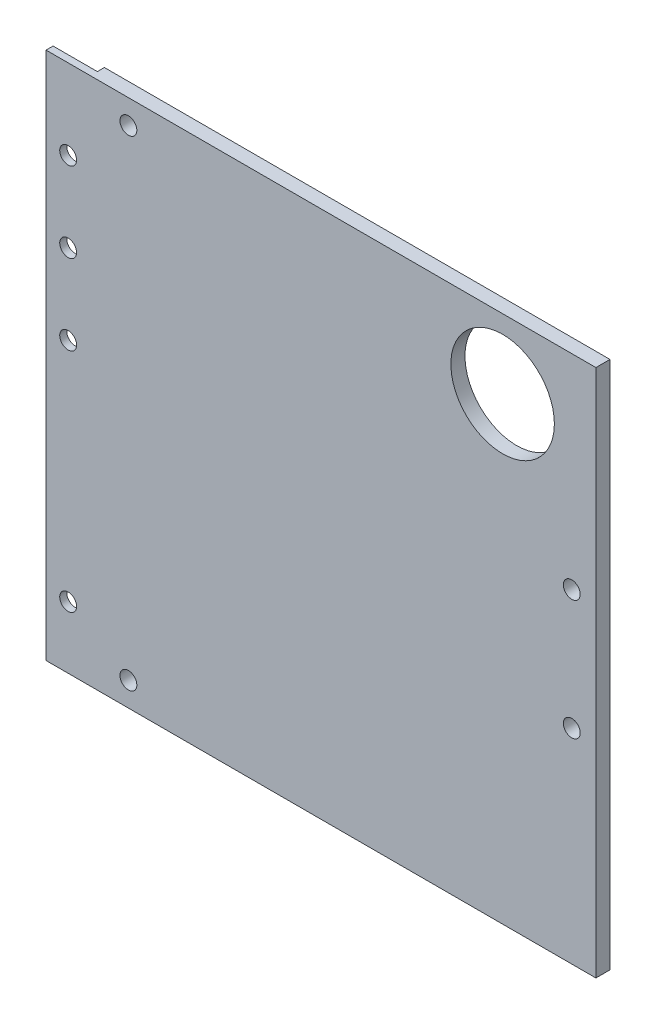
ISO-10303-21;
HEADER;
FILE_DESCRIPTION(('STEP AP214'),'2;1');
FILE_NAME('part.step','',(''),(''),'','','');
FILE_SCHEMA(('AUTOMOTIVE_DESIGN { 1 0 10303 214 1 1 1 1 }'));
ENDSEC;
DATA;
#1=APPLICATION_CONTEXT('core data for automotive mechanical design processes');
#2=APPLICATION_PROTOCOL_DEFINITION('international standard','automotive_design',2000,#1);
#3=PRODUCT_CONTEXT('',#1,'mechanical');
#4=PRODUCT('Part','Part','',(#3));
#5=PRODUCT_RELATED_PRODUCT_CATEGORY('part','',(#4));
#6=PRODUCT_DEFINITION_FORMATION('','',#4);
#7=PRODUCT_DEFINITION_CONTEXT('part definition',#1,'design');
#8=PRODUCT_DEFINITION('design','',#6,#7);
#9=PRODUCT_DEFINITION_SHAPE('','',#8);
#10=(LENGTH_UNIT() NAMED_UNIT(*) SI_UNIT(.MILLI.,.METRE.));
#11=(NAMED_UNIT(*) PLANE_ANGLE_UNIT() SI_UNIT($,.RADIAN.));
#12=(NAMED_UNIT(*) SI_UNIT($,.STERADIAN.) SOLID_ANGLE_UNIT());
#13=UNCERTAINTY_MEASURE_WITH_UNIT(LENGTH_MEASURE(1.E-05),#10,'distance_accuracy_value','');
#14=(GEOMETRIC_REPRESENTATION_CONTEXT(3) GLOBAL_UNCERTAINTY_ASSIGNED_CONTEXT((#13)) GLOBAL_UNIT_ASSIGNED_CONTEXT((#10,
#11,#12)) REPRESENTATION_CONTEXT('',''));
#15=CARTESIAN_POINT('',(0.,0.,0.));
#16=DIRECTION('',(0.,0.,1.));
#17=DIRECTION('',(1.,0.,0.));
#18=AXIS2_PLACEMENT_3D('',#15,#16,#17);
#19=CARTESIAN_POINT('',(0.,0.,0.));
#20=DIRECTION('',(0.,0.,1.));
#21=DIRECTION('',(1.,0.,0.));
#22=AXIS2_PLACEMENT_3D('',#19,#20,#21);
#23=PLANE('',#22);
#24=CARTESIAN_POINT('',(-42.7763067048313,27.3481692845822,0.));
#25=DIRECTION('',(0.,0.,1.));
#26=DIRECTION('',(1.,0.,0.));
#27=AXIS2_PLACEMENT_3D('',#24,#25,#26);
#28=CIRCLE('',#27,1.90500000000001);
#29=CARTESIAN_POINT('',(-40.8713067048313,27.3481692845822,0.));
#30=VERTEX_POINT('',#29);
#31=EDGE_CURVE('E129',#30,#30,#28,.T.);
#32=ORIENTED_EDGE('',*,*,#31,.T.);
#33=EDGE_LOOP('',(#32));
#34=FACE_BOUND('',#33,.T.);
#35=CARTESIAN_POINT('',(41.7296932951687,17.0901692845822,0.));
#36=DIRECTION('',(0.,0.,1.));
#37=DIRECTION('',(1.,0.,0.));
#38=AXIS2_PLACEMENT_3D('',#35,#36,#37);
#39=CIRCLE('',#38,11.685);
#40=CARTESIAN_POINT('',(53.4146932951687,17.0901692845822,0.));
#41=VERTEX_POINT('',#40);
#42=EDGE_CURVE('E126',#41,#41,#39,.T.);
#43=ORIENTED_EDGE('',*,*,#42,.T.);
#44=EDGE_LOOP('',(#43));
#45=FACE_BOUND('',#44,.T.);
#46=CARTESIAN_POINT('',(-42.7763067048313,-81.1278307154178,0.));
#47=DIRECTION('',(0.,0.,1.));
#48=DIRECTION('',(1.,0.,0.));
#49=AXIS2_PLACEMENT_3D('',#46,#47,#48);
#50=CIRCLE('',#49,1.90500000000001);
#51=CARTESIAN_POINT('',(-40.8713067048313,-81.1278307154178,0.));
#52=VERTEX_POINT('',#51);
#53=EDGE_CURVE('E130',#52,#52,#50,.T.);
#54=ORIENTED_EDGE('',*,*,#53,.T.);
#55=EDGE_LOOP('',(#54));
#56=FACE_BOUND('',#55,.T.);
#57=CARTESIAN_POINT('',(57.3436932951687,-13.3398307154178,0.));
#58=DIRECTION('',(0.,0.,1.));
#59=DIRECTION('',(1.,0.,0.));
#60=AXIS2_PLACEMENT_3D('',#57,#58,#59);
#61=CIRCLE('',#60,1.90500000000001);
#62=CARTESIAN_POINT('',(59.2486932951687,-13.3398307154178,0.));
#63=VERTEX_POINT('',#62);
#64=EDGE_CURVE('E133',#63,#63,#61,.T.);
#65=ORIENTED_EDGE('',*,*,#64,.T.);
#66=EDGE_LOOP('',(#65));
#67=FACE_BOUND('',#66,.T.);
#68=CARTESIAN_POINT('',(57.3436932951687,-40.4398307154178,0.));
#69=DIRECTION('',(0.,0.,1.));
#70=DIRECTION('',(1.,0.,0.));
#71=AXIS2_PLACEMENT_3D('',#68,#69,#70);
#72=CIRCLE('',#71,1.90500000000001);
#73=CARTESIAN_POINT('',(59.2486932951687,-40.4398307154178,0.));
#74=VERTEX_POINT('',#73);
#75=EDGE_CURVE('E125',#74,#74,#72,.T.);
#76=ORIENTED_EDGE('',*,*,#75,.T.);
#77=EDGE_LOOP('',(#76));
#78=FACE_BOUND('',#77,.T.);
#79=DIRECTION('',(0.,-1.,0.));
#80=VECTOR('',#79,1.);
#81=CARTESIAN_POINT('',(-51.3763067048313,32.8001682644905,-2.00872967033113E-07));
#82=LINE('',#81,#80);
#83=CARTESIAN_POINT('',(-51.3763067048313,32.8001692845822,0.));
#84=VERTEX_POINT('',#83);
#85=CARTESIAN_POINT('',(-51.3763067048313,-86.5798307154178,-2.00872952413279E-07));
#86=VERTEX_POINT('',#85);
#87=EDGE_CURVE('E103',#84,#86,#82,.T.);
#88=ORIENTED_EDGE('',*,*,#87,.F.);
#89=DIRECTION('',(-1.,0.,0.));
#90=VECTOR('',#89,1.);
#91=CARTESIAN_POINT('',(-61.3763067048313,32.8001692845822,0.));
#92=LINE('',#91,#90);
#93=CARTESIAN_POINT('',(62.7936932951687,32.8001692845822,0.));
#94=VERTEX_POINT('',#93);
#95=EDGE_CURVE('E116',#94,#84,#92,.T.);
#96=ORIENTED_EDGE('',*,*,#95,.F.);
#97=DIRECTION('',(0.,1.,0.));
#98=VECTOR('',#97,1.);
#99=CARTESIAN_POINT('',(62.7936932951687,32.8001692845822,0.));
#100=LINE('',#99,#98);
#101=CARTESIAN_POINT('',(62.7936932951687,-86.5798307154178,0.));
#102=VERTEX_POINT('',#101);
#103=EDGE_CURVE('E75',#102,#94,#100,.T.);
#104=ORIENTED_EDGE('',*,*,#103,.F.);
#105=DIRECTION('',(1.,0.,0.));
#106=VECTOR('',#105,1.);
#107=CARTESIAN_POINT('',(-61.3763067048313,-86.5798307154178,0.));
#108=LINE('',#107,#106);
#109=EDGE_CURVE('E155',#86,#102,#108,.T.);
#110=ORIENTED_EDGE('',*,*,#109,.F.);
#111=EDGE_LOOP('',(#88,#96,#104,#110));
#112=FACE_BOUND('',#111,.T.);
#113=ADVANCED_FACE('F35',(#34,#45,#56,#67,#78,#112),#23,.F.);
#114=CARTESIAN_POINT('',(-61.3763067048313,32.8001692845822,3.18));
#115=DIRECTION('',(1.,0.,0.));
#116=DIRECTION('',(0.,1.,0.));
#117=AXIS2_PLACEMENT_3D('',#114,#115,#116);
#118=PLANE('',#117);
#119=DIRECTION('',(0.,0.,-1.));
#120=VECTOR('',#119,1.);
#121=CARTESIAN_POINT('',(-61.3763067048313,32.8001692845822,3.18));
#122=LINE('',#121,#120);
#123=CARTESIAN_POINT('',(-61.3763067048313,32.8001692845822,3.18));
#124=VERTEX_POINT('',#123);
#125=CARTESIAN_POINT('',(-61.3763067048313,32.8001682644905,1.58999979912703));
#126=VERTEX_POINT('',#125);
#127=EDGE_CURVE('E162',#124,#126,#122,.T.);
#128=ORIENTED_EDGE('',*,*,#127,.T.);
#129=DIRECTION('',(0.,1.,0.));
#130=VECTOR('',#129,1.);
#131=CARTESIAN_POINT('',(-61.3763067048313,32.8001682644905,1.58999979912703));
#132=LINE('',#131,#130);
#133=CARTESIAN_POINT('',(-61.3763067048313,-86.5798307154178,1.58999979912705));
#134=VERTEX_POINT('',#133);
#135=EDGE_CURVE('E109',#134,#126,#132,.T.);
#136=ORIENTED_EDGE('',*,*,#135,.F.);
#137=DIRECTION('',(0.,0.,-1.));
#138=VECTOR('',#137,1.);
#139=CARTESIAN_POINT('',(-61.3763067048313,-86.5798307154178,3.18));
#140=LINE('',#139,#138);
#141=CARTESIAN_POINT('',(-61.3763067048313,-86.5798307154178,3.18));
#142=VERTEX_POINT('',#141);
#143=EDGE_CURVE('E11',#142,#134,#140,.T.);
#144=ORIENTED_EDGE('',*,*,#143,.F.);
#145=DIRECTION('',(0.,-1.,0.));
#146=VECTOR('',#145,1.);
#147=CARTESIAN_POINT('',(-61.3763067048313,32.8001692845822,3.18));
#148=LINE('',#147,#146);
#149=EDGE_CURVE('E156',#124,#142,#148,.T.);
#150=ORIENTED_EDGE('',*,*,#149,.F.);
#151=EDGE_LOOP('',(#128,#136,#144,#150));
#152=FACE_BOUND('',#151,.T.);
#153=ADVANCED_FACE('F37',(#152),#118,.F.);
#154=CARTESIAN_POINT('',(-61.3763067048313,-86.5798307154178,3.18));
#155=DIRECTION('',(0.,1.,0.));
#156=DIRECTION('',(0.,0.,1.));
#157=AXIS2_PLACEMENT_3D('',#154,#155,#156);
#158=PLANE('',#157);
#159=ORIENTED_EDGE('',*,*,#143,.T.);
#160=DIRECTION('',(1.,0.,0.));
#161=VECTOR('',#160,1.);
#162=CARTESIAN_POINT('',(-61.3763067048313,-86.5798307154178,1.58999979912705));
#163=LINE('',#162,#161);
#164=CARTESIAN_POINT('',(-51.3763067048313,-86.5798307154178,1.58999979912705));
#165=VERTEX_POINT('',#164);
#166=EDGE_CURVE('E123',#134,#165,#163,.T.);
#167=ORIENTED_EDGE('',*,*,#166,.T.);
#168=DIRECTION('',(0.,0.,1.));
#169=VECTOR('',#168,1.);
#170=CARTESIAN_POINT('',(-51.3763067048313,-86.5798307154178,3.18));
#171=LINE('',#170,#169);
#172=EDGE_CURVE('E100',#86,#165,#171,.T.);
#173=ORIENTED_EDGE('',*,*,#172,.F.);
#174=ORIENTED_EDGE('',*,*,#109,.T.);
#175=DIRECTION('',(0.,0.,-1.));
#176=VECTOR('',#175,1.);
#177=CARTESIAN_POINT('',(62.7936932951687,-86.5798307154178,3.18));
#178=LINE('',#177,#176);
#179=CARTESIAN_POINT('',(62.7936932951687,-86.5798307154178,3.18));
#180=VERTEX_POINT('',#179);
#181=EDGE_CURVE('E43',#180,#102,#178,.T.);
#182=ORIENTED_EDGE('',*,*,#181,.F.);
#183=DIRECTION('',(1.,0.,0.));
#184=VECTOR('',#183,1.);
#185=CARTESIAN_POINT('',(-61.3763067048313,-86.5798307154178,3.18));
#186=LINE('',#185,#184);
#187=EDGE_CURVE('E82',#142,#180,#186,.T.);
#188=ORIENTED_EDGE('',*,*,#187,.F.);
#189=EDGE_LOOP('',(#159,#167,#173,#174,#182,#188));
#190=FACE_BOUND('',#189,.T.);
#191=ADVANCED_FACE('F228',(#190),#158,.F.);
#192=CARTESIAN_POINT('',(62.7936932951687,32.8001692845822,3.18));
#193=DIRECTION('',(-1.,0.,0.));
#194=DIRECTION('',(0.,0.,1.));
#195=AXIS2_PLACEMENT_3D('',#192,#193,#194);
#196=PLANE('',#195);
#197=ORIENTED_EDGE('',*,*,#103,.T.);
#198=DIRECTION('',(0.,0.,-1.));
#199=VECTOR('',#198,1.);
#200=CARTESIAN_POINT('',(62.7936932951687,32.8001692845822,3.18));
#201=LINE('',#200,#199);
#202=CARTESIAN_POINT('',(62.7936932951687,32.8001692845822,3.18));
#203=VERTEX_POINT('',#202);
#204=EDGE_CURVE('E167',#203,#94,#201,.T.);
#205=ORIENTED_EDGE('',*,*,#204,.F.);
#206=DIRECTION('',(0.,1.,0.));
#207=VECTOR('',#206,1.);
#208=CARTESIAN_POINT('',(62.7936932951687,32.8001692845822,3.18));
#209=LINE('',#208,#207);
#210=EDGE_CURVE('E159',#180,#203,#209,.T.);
#211=ORIENTED_EDGE('',*,*,#210,.F.);
#212=ORIENTED_EDGE('',*,*,#181,.T.);
#213=EDGE_LOOP('',(#197,#205,#211,#212));
#214=FACE_BOUND('',#213,.T.);
#215=ADVANCED_FACE('F169',(#214),#196,.F.);
#216=CARTESIAN_POINT('',(-61.3763067048313,32.8001692845822,3.18));
#217=DIRECTION('',(0.,-1.,0.));
#218=DIRECTION('',(0.,0.,-1.));
#219=AXIS2_PLACEMENT_3D('',#216,#217,#218);
#220=PLANE('',#219);
#221=DIRECTION('',(0.,0.,-1.));
#222=VECTOR('',#221,1.);
#223=CARTESIAN_POINT('',(-51.3763067048313,32.8001682644905,-2.00872967033113E-07));
#224=LINE('',#223,#222);
#225=CARTESIAN_POINT('',(-51.3763067048313,32.8001682644905,1.58999979912703));
#226=VERTEX_POINT('',#225);
#227=EDGE_CURVE('E50',#226,#84,#224,.T.);
#228=ORIENTED_EDGE('',*,*,#227,.F.);
#229=DIRECTION('',(-1.,0.,0.));
#230=VECTOR('',#229,1.);
#231=CARTESIAN_POINT('',(-51.3763067048313,32.8001682644905,1.58999979912703));
#232=LINE('',#231,#230);
#233=EDGE_CURVE('E106',#226,#126,#232,.T.);
#234=ORIENTED_EDGE('',*,*,#233,.T.);
#235=ORIENTED_EDGE('',*,*,#127,.F.);
#236=DIRECTION('',(-1.,0.,0.));
#237=VECTOR('',#236,1.);
#238=CARTESIAN_POINT('',(-61.3763067048313,32.8001692845822,3.18));
#239=LINE('',#238,#237);
#240=EDGE_CURVE('E59',#203,#124,#239,.T.);
#241=ORIENTED_EDGE('',*,*,#240,.F.);
#242=ORIENTED_EDGE('',*,*,#204,.T.);
#243=ORIENTED_EDGE('',*,*,#95,.T.);
#244=EDGE_LOOP('',(#228,#234,#235,#241,#242,#243));
#245=FACE_BOUND('',#244,.T.);
#246=ADVANCED_FACE('F114',(#245),#220,.F.);
#247=CARTESIAN_POINT('',(0.,0.,3.18));
#248=DIRECTION('',(0.,0.,1.));
#249=DIRECTION('',(1.,0.,0.));
#250=AXIS2_PLACEMENT_3D('',#247,#248,#249);
#251=PLANE('',#250);
#252=CARTESIAN_POINT('',(-56.3763067048313,14.7201682644905,3.18));
#253=DIRECTION('',(0.,0.,1.));
#254=DIRECTION('',(1.,0.,0.));
#255=AXIS2_PLACEMENT_3D('',#252,#253,#254);
#256=CIRCLE('',#255,1.905);
#257=CARTESIAN_POINT('',(-54.4713067048313,14.7201682644905,3.18));
#258=VERTEX_POINT('',#257);
#259=EDGE_CURVE('E120',#258,#258,#256,.T.);
#260=ORIENTED_EDGE('',*,*,#259,.F.);
#261=EDGE_LOOP('',(#260));
#262=FACE_BOUND('',#261,.T.);
#263=CARTESIAN_POINT('',(-56.3763067048313,-21.4498317355095,3.18));
#264=DIRECTION('',(0.,0.,1.));
#265=DIRECTION('',(1.,0.,0.));
#266=AXIS2_PLACEMENT_3D('',#263,#264,#265);
#267=CIRCLE('',#266,1.905);
#268=CARTESIAN_POINT('',(-54.4713067048313,-21.4498317355095,3.18));
#269=VERTEX_POINT('',#268);
#270=EDGE_CURVE('E175',#269,#269,#267,.T.);
#271=ORIENTED_EDGE('',*,*,#270,.F.);
#272=EDGE_LOOP('',(#271));
#273=FACE_BOUND('',#272,.T.);
#274=CARTESIAN_POINT('',(-56.3763067048313,-72.5798307154178,3.18));
#275=DIRECTION('',(0.,0.,1.));
#276=DIRECTION('',(1.,0.,0.));
#277=AXIS2_PLACEMENT_3D('',#274,#275,#276);
#278=CIRCLE('',#277,1.905);
#279=CARTESIAN_POINT('',(-54.4713067048313,-72.5798307154178,3.18));
#280=VERTEX_POINT('',#279);
#281=EDGE_CURVE('E178',#280,#280,#278,.T.);
#282=ORIENTED_EDGE('',*,*,#281,.F.);
#283=EDGE_LOOP('',(#282));
#284=FACE_BOUND('',#283,.T.);
#285=CARTESIAN_POINT('',(-56.3763067048313,-3.36983173550949,3.18));
#286=DIRECTION('',(0.,0.,1.));
#287=DIRECTION('',(1.,0.,0.));
#288=AXIS2_PLACEMENT_3D('',#285,#286,#287);
#289=CIRCLE('',#288,1.90500000000001);
#290=CARTESIAN_POINT('',(-54.4713067048313,-3.36983173550949,3.18));
#291=VERTEX_POINT('',#290);
#292=EDGE_CURVE('E181',#291,#291,#289,.T.);
#293=ORIENTED_EDGE('',*,*,#292,.F.);
#294=EDGE_LOOP('',(#293));
#295=FACE_BOUND('',#294,.T.);
#296=CARTESIAN_POINT('',(57.3436932951687,-40.4398307154178,3.18));
#297=DIRECTION('',(0.,0.,1.));
#298=DIRECTION('',(1.,0.,0.));
#299=AXIS2_PLACEMENT_3D('',#296,#297,#298);
#300=CIRCLE('',#299,1.90500000000001);
#301=CARTESIAN_POINT('',(59.2486932951687,-40.4398307154178,3.18));
#302=VERTEX_POINT('',#301);
#303=EDGE_CURVE('E152',#302,#302,#300,.F.);
#304=ORIENTED_EDGE('',*,*,#303,.T.);
#305=EDGE_LOOP('',(#304));
#306=FACE_BOUND('',#305,.T.);
#307=CARTESIAN_POINT('',(57.3436932951687,-13.3398307154178,3.18));
#308=DIRECTION('',(0.,0.,1.));
#309=DIRECTION('',(1.,0.,0.));
#310=AXIS2_PLACEMENT_3D('',#307,#308,#309);
#311=CIRCLE('',#310,1.90500000000001);
#312=CARTESIAN_POINT('',(59.2486932951687,-13.3398307154178,3.18));
#313=VERTEX_POINT('',#312);
#314=EDGE_CURVE('E149',#313,#313,#311,.F.);
#315=ORIENTED_EDGE('',*,*,#314,.T.);
#316=EDGE_LOOP('',(#315));
#317=FACE_BOUND('',#316,.T.);
#318=CARTESIAN_POINT('',(-42.7763067048313,-81.1278307154178,3.18));
#319=DIRECTION('',(0.,0.,1.));
#320=DIRECTION('',(1.,0.,0.));
#321=AXIS2_PLACEMENT_3D('',#318,#319,#320);
#322=CIRCLE('',#321,1.90500000000001);
#323=CARTESIAN_POINT('',(-40.8713067048313,-81.1278307154178,3.18));
#324=VERTEX_POINT('',#323);
#325=EDGE_CURVE('E146',#324,#324,#322,.F.);
#326=ORIENTED_EDGE('',*,*,#325,.T.);
#327=EDGE_LOOP('',(#326));
#328=FACE_BOUND('',#327,.T.);
#329=CARTESIAN_POINT('',(41.7296932951687,17.0901692845822,3.18));
#330=DIRECTION('',(0.,0.,1.));
#331=DIRECTION('',(1.,0.,0.));
#332=AXIS2_PLACEMENT_3D('',#329,#330,#331);
#333=CIRCLE('',#332,11.685);
#334=CARTESIAN_POINT('',(53.4146932951687,17.0901692845822,3.18));
#335=VERTEX_POINT('',#334);
#336=EDGE_CURVE('E143',#335,#335,#333,.F.);
#337=ORIENTED_EDGE('',*,*,#336,.T.);
#338=EDGE_LOOP('',(#337));
#339=FACE_BOUND('',#338,.T.);
#340=CARTESIAN_POINT('',(-42.7763067048313,27.3481692845822,3.18));
#341=DIRECTION('',(0.,0.,1.));
#342=DIRECTION('',(1.,0.,0.));
#343=AXIS2_PLACEMENT_3D('',#340,#341,#342);
#344=CIRCLE('',#343,1.90500000000001);
#345=CARTESIAN_POINT('',(-40.8713067048313,27.3481692845822,3.18));
#346=VERTEX_POINT('',#345);
#347=EDGE_CURVE('E140',#346,#346,#344,.F.);
#348=ORIENTED_EDGE('',*,*,#347,.T.);
#349=EDGE_LOOP('',(#348));
#350=FACE_BOUND('',#349,.T.);
#351=ORIENTED_EDGE('',*,*,#149,.T.);
#352=ORIENTED_EDGE('',*,*,#187,.T.);
#353=ORIENTED_EDGE('',*,*,#210,.T.);
#354=ORIENTED_EDGE('',*,*,#240,.T.);
#355=EDGE_LOOP('',(#351,#352,#353,#354));
#356=FACE_BOUND('',#355,.T.);
#357=ADVANCED_FACE('F233',(#262,#273,#284,#295,#306,#317,#328,#339,#350,#356),#251,.T.);
#358=CARTESIAN_POINT('',(-42.7763067048313,27.3481692845822,23.18));
#359=DIRECTION('',(0.,0.,-1.));
#360=DIRECTION('',(-1.,0.,0.));
#361=AXIS2_PLACEMENT_3D('',#358,#359,#360);
#362=CYLINDRICAL_SURFACE('',#361,1.90500000000001);
#363=ORIENTED_EDGE('',*,*,#347,.F.);
#364=EDGE_LOOP('',(#363));
#365=FACE_BOUND('',#364,.T.);
#366=ORIENTED_EDGE('',*,*,#31,.F.);
#367=EDGE_LOOP('',(#366));
#368=FACE_BOUND('',#367,.T.);
#369=ADVANCED_FACE('F244',(#365,#368),#362,.F.);
#370=CARTESIAN_POINT('',(41.7296932951687,17.0901692845822,23.18));
#371=DIRECTION('',(0.,0.,-1.));
#372=DIRECTION('',(-1.,0.,0.));
#373=AXIS2_PLACEMENT_3D('',#370,#371,#372);
#374=CYLINDRICAL_SURFACE('',#373,11.685);
#375=ORIENTED_EDGE('',*,*,#336,.F.);
#376=EDGE_LOOP('',(#375));
#377=FACE_BOUND('',#376,.T.);
#378=ORIENTED_EDGE('',*,*,#42,.F.);
#379=EDGE_LOOP('',(#378));
#380=FACE_BOUND('',#379,.T.);
#381=ADVANCED_FACE('F249',(#377,#380),#374,.F.);
#382=CARTESIAN_POINT('',(-42.7763067048313,-81.1278307154178,23.18));
#383=DIRECTION('',(0.,0.,-1.));
#384=DIRECTION('',(-1.,0.,0.));
#385=AXIS2_PLACEMENT_3D('',#382,#383,#384);
#386=CYLINDRICAL_SURFACE('',#385,1.90500000000001);
#387=ORIENTED_EDGE('',*,*,#325,.F.);
#388=EDGE_LOOP('',(#387));
#389=FACE_BOUND('',#388,.T.);
#390=ORIENTED_EDGE('',*,*,#53,.F.);
#391=EDGE_LOOP('',(#390));
#392=FACE_BOUND('',#391,.T.);
#393=ADVANCED_FACE('F273',(#389,#392),#386,.F.);
#394=CARTESIAN_POINT('',(57.3436932951687,-13.3398307154178,23.18));
#395=DIRECTION('',(0.,0.,-1.));
#396=DIRECTION('',(-1.,0.,0.));
#397=AXIS2_PLACEMENT_3D('',#394,#395,#396);
#398=CYLINDRICAL_SURFACE('',#397,1.90500000000001);
#399=ORIENTED_EDGE('',*,*,#314,.F.);
#400=EDGE_LOOP('',(#399));
#401=FACE_BOUND('',#400,.T.);
#402=ORIENTED_EDGE('',*,*,#64,.F.);
#403=EDGE_LOOP('',(#402));
#404=FACE_BOUND('',#403,.T.);
#405=ADVANCED_FACE('F284',(#401,#404),#398,.F.);
#406=CARTESIAN_POINT('',(57.3436932951687,-40.4398307154178,23.18));
#407=DIRECTION('',(0.,0.,-1.));
#408=DIRECTION('',(-1.,0.,0.));
#409=AXIS2_PLACEMENT_3D('',#406,#407,#408);
#410=CYLINDRICAL_SURFACE('',#409,1.90500000000001);
#411=ORIENTED_EDGE('',*,*,#303,.F.);
#412=EDGE_LOOP('',(#411));
#413=FACE_BOUND('',#412,.T.);
#414=ORIENTED_EDGE('',*,*,#75,.F.);
#415=EDGE_LOOP('',(#414));
#416=FACE_BOUND('',#415,.T.);
#417=ADVANCED_FACE('F201',(#413,#416),#410,.F.);
#418=CARTESIAN_POINT('',(-51.3763067048313,32.8001682644905,1.58999979912703));
#419=DIRECTION('',(0.,0.,1.));
#420=DIRECTION('',(0.,-1.,0.));
#421=AXIS2_PLACEMENT_3D('',#418,#419,#420);
#422=PLANE('',#421);
#423=CARTESIAN_POINT('',(-56.3763067048313,14.7201682644905,1.58999979912704));
#424=DIRECTION('',(0.,0.,-1.));
#425=DIRECTION('',(0.,1.,0.));
#426=AXIS2_PLACEMENT_3D('',#423,#424,#425);
#427=CIRCLE('',#426,1.905);
#428=CARTESIAN_POINT('',(-56.3763067048313,16.6251682644905,1.58999979912704));
#429=VERTEX_POINT('',#428);
#430=EDGE_CURVE('E184',#429,#429,#427,.T.);
#431=ORIENTED_EDGE('',*,*,#430,.F.);
#432=EDGE_LOOP('',(#431));
#433=FACE_BOUND('',#432,.T.);
#434=CARTESIAN_POINT('',(-56.3763067048313,-21.4498317355095,1.58999979912704));
#435=DIRECTION('',(0.,0.,-1.));
#436=DIRECTION('',(0.,1.,0.));
#437=AXIS2_PLACEMENT_3D('',#434,#435,#436);
#438=CIRCLE('',#437,1.905);
#439=CARTESIAN_POINT('',(-56.3763067048313,-19.5448317355095,1.58999979912704));
#440=VERTEX_POINT('',#439);
#441=EDGE_CURVE('E191',#440,#440,#438,.T.);
#442=ORIENTED_EDGE('',*,*,#441,.F.);
#443=EDGE_LOOP('',(#442));
#444=FACE_BOUND('',#443,.T.);
#445=CARTESIAN_POINT('',(-56.3763067048313,-72.5798307154178,1.58999979912705));
#446=DIRECTION('',(0.,0.,-1.));
#447=DIRECTION('',(0.,1.,0.));
#448=AXIS2_PLACEMENT_3D('',#445,#446,#447);
#449=CIRCLE('',#448,1.905);
#450=CARTESIAN_POINT('',(-56.3763067048313,-70.6748307154178,1.58999979912705));
#451=VERTEX_POINT('',#450);
#452=EDGE_CURVE('E188',#451,#451,#449,.T.);
#453=ORIENTED_EDGE('',*,*,#452,.F.);
#454=EDGE_LOOP('',(#453));
#455=FACE_BOUND('',#454,.T.);
#456=CARTESIAN_POINT('',(-56.3763067048313,-3.36983173550949,1.58999979912704));
#457=DIRECTION('',(0.,0.,-1.));
#458=DIRECTION('',(0.,1.,0.));
#459=AXIS2_PLACEMENT_3D('',#456,#457,#458);
#460=CIRCLE('',#459,1.90500000000001);
#461=CARTESIAN_POINT('',(-56.3763067048313,-1.46483173550948,1.58999979912704));
#462=VERTEX_POINT('',#461);
#463=EDGE_CURVE('E185',#462,#462,#460,.T.);
#464=ORIENTED_EDGE('',*,*,#463,.F.);
#465=EDGE_LOOP('',(#464));
#466=FACE_BOUND('',#465,.T.);
#467=ORIENTED_EDGE('',*,*,#135,.T.);
#468=ORIENTED_EDGE('',*,*,#233,.F.);
#469=DIRECTION('',(0.,1.,0.));
#470=VECTOR('',#469,1.);
#471=CARTESIAN_POINT('',(-51.3763067048313,32.8001682644905,1.58999979912703));
#472=LINE('',#471,#470);
#473=EDGE_CURVE('E96',#165,#226,#472,.T.);
#474=ORIENTED_EDGE('',*,*,#473,.F.);
#475=ORIENTED_EDGE('',*,*,#166,.F.);
#476=EDGE_LOOP('',(#467,#468,#474,#475));
#477=FACE_BOUND('',#476,.T.);
#478=ADVANCED_FACE('F107',(#433,#444,#455,#466,#477),#422,.F.);
#479=CARTESIAN_POINT('',(-51.3763067048313,0.,0.));
#480=DIRECTION('',(-1.,0.,0.));
#481=DIRECTION('',(0.,0.,1.));
#482=AXIS2_PLACEMENT_3D('',#479,#480,#481);
#483=PLANE('',#482);
#484=ORIENTED_EDGE('',*,*,#172,.T.);
#485=ORIENTED_EDGE('',*,*,#473,.T.);
#486=ORIENTED_EDGE('',*,*,#227,.T.);
#487=ORIENTED_EDGE('',*,*,#87,.T.);
#488=EDGE_LOOP('',(#484,#485,#486,#487));
#489=FACE_BOUND('',#488,.T.);
#490=ADVANCED_FACE('F98',(#489),#483,.T.);
#491=CARTESIAN_POINT('',(-56.3763067048313,-3.36983173550949,6.58999979912704));
#492=DIRECTION('',(0.,0.,-1.));
#493=DIRECTION('',(0.,1.,0.));
#494=AXIS2_PLACEMENT_3D('',#491,#492,#493);
#495=CYLINDRICAL_SURFACE('',#494,1.90500000000001);
#496=ORIENTED_EDGE('',*,*,#292,.T.);
#497=EDGE_LOOP('',(#496));
#498=FACE_BOUND('',#497,.T.);
#499=ORIENTED_EDGE('',*,*,#463,.T.);
#500=EDGE_LOOP('',(#499));
#501=FACE_BOUND('',#500,.T.);
#502=ADVANCED_FACE('F209',(#498,#501),#495,.F.);
#503=CARTESIAN_POINT('',(-56.3763067048313,-72.5798307154178,6.58999979912705));
#504=DIRECTION('',(0.,0.,-1.));
#505=DIRECTION('',(0.,1.,0.));
#506=AXIS2_PLACEMENT_3D('',#503,#504,#505);
#507=CYLINDRICAL_SURFACE('',#506,1.905);
#508=ORIENTED_EDGE('',*,*,#281,.T.);
#509=EDGE_LOOP('',(#508));
#510=FACE_BOUND('',#509,.T.);
#511=ORIENTED_EDGE('',*,*,#452,.T.);
#512=EDGE_LOOP('',(#511));
#513=FACE_BOUND('',#512,.T.);
#514=ADVANCED_FACE('F211',(#510,#513),#507,.F.);
#515=CARTESIAN_POINT('',(-56.3763067048313,-21.4498317355095,6.58999979912704));
#516=DIRECTION('',(0.,0.,-1.));
#517=DIRECTION('',(0.,1.,0.));
#518=AXIS2_PLACEMENT_3D('',#515,#516,#517);
#519=CYLINDRICAL_SURFACE('',#518,1.905);
#520=ORIENTED_EDGE('',*,*,#270,.T.);
#521=EDGE_LOOP('',(#520));
#522=FACE_BOUND('',#521,.T.);
#523=ORIENTED_EDGE('',*,*,#441,.T.);
#524=EDGE_LOOP('',(#523));
#525=FACE_BOUND('',#524,.T.);
#526=ADVANCED_FACE('F218',(#522,#525),#519,.F.);
#527=CARTESIAN_POINT('',(-56.3763067048313,14.7201682644905,6.58999979912704));
#528=DIRECTION('',(0.,0.,-1.));
#529=DIRECTION('',(0.,1.,0.));
#530=AXIS2_PLACEMENT_3D('',#527,#528,#529);
#531=CYLINDRICAL_SURFACE('',#530,1.905);
#532=ORIENTED_EDGE('',*,*,#259,.T.);
#533=EDGE_LOOP('',(#532));
#534=FACE_BOUND('',#533,.T.);
#535=ORIENTED_EDGE('',*,*,#430,.T.);
#536=EDGE_LOOP('',(#535));
#537=FACE_BOUND('',#536,.T.);
#538=ADVANCED_FACE('F197',(#534,#537),#531,.F.);
#539=CLOSED_SHELL('',(#113,#153,#191,#215,#246,#357,#369,#381,#393,#405,#417,#478,#490,#502,
#514,#526,#538));
#540=MANIFOLD_SOLID_BREP('B2',#539);
#541=ADVANCED_BREP_SHAPE_REPRESENTATION('',(#18,#540),#14);
#542=SHAPE_DEFINITION_REPRESENTATION(#9,#541);
ENDSEC;
END-ISO-10303-21;
